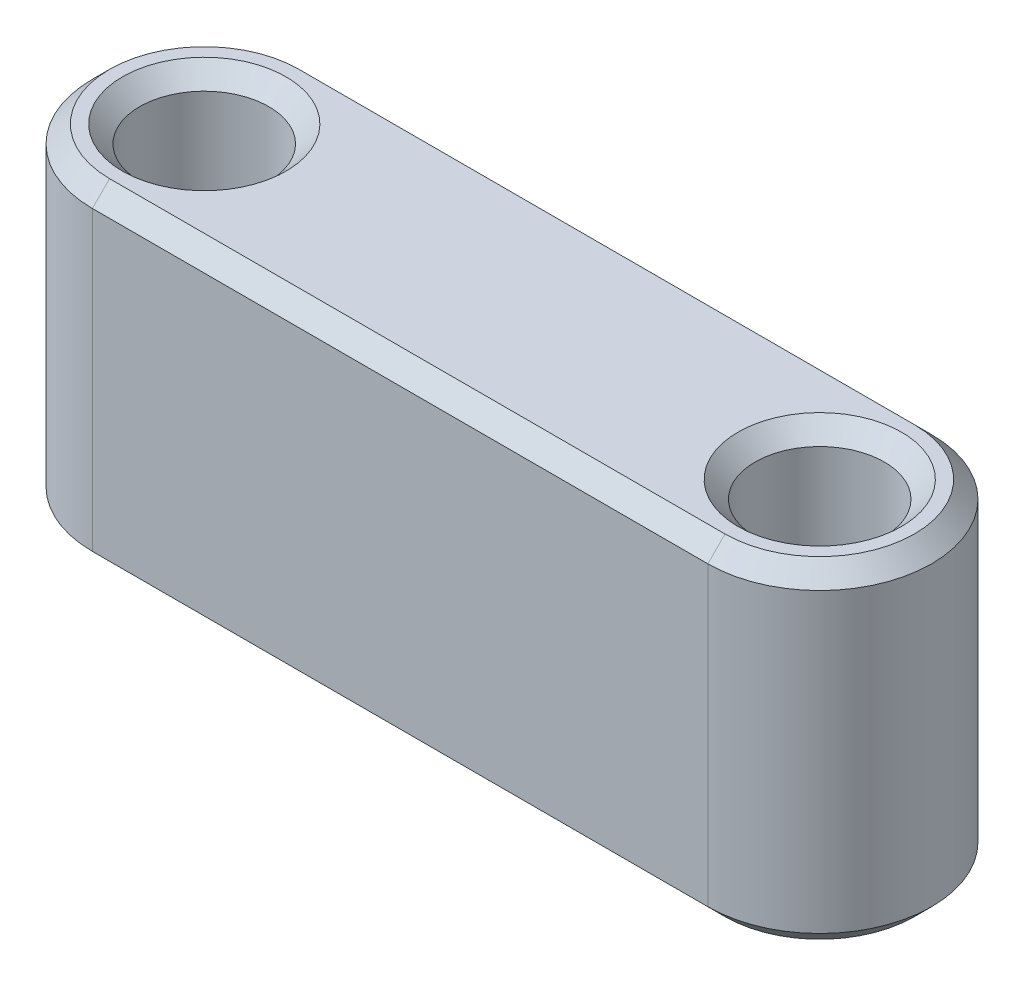
ISO-10303-21;
HEADER;
FILE_DESCRIPTION(('STEP AP214'),'2;1');
FILE_NAME('part.step','',(''),(''),'','','');
FILE_SCHEMA(('AUTOMOTIVE_DESIGN { 1 0 10303 214 1 1 1 1 }'));
ENDSEC;
DATA;
#1=APPLICATION_CONTEXT('core data for automotive mechanical design processes');
#2=APPLICATION_PROTOCOL_DEFINITION('international standard','automotive_design',2000,#1);
#3=PRODUCT_CONTEXT('',#1,'mechanical');
#4=PRODUCT('Part','Part','',(#3));
#5=PRODUCT_RELATED_PRODUCT_CATEGORY('part','',(#4));
#6=PRODUCT_DEFINITION_FORMATION('','',#4);
#7=PRODUCT_DEFINITION_CONTEXT('part definition',#1,'design');
#8=PRODUCT_DEFINITION('design','',#6,#7);
#9=PRODUCT_DEFINITION_SHAPE('','',#8);
#10=(LENGTH_UNIT() NAMED_UNIT(*) SI_UNIT(.MILLI.,.METRE.));
#11=(NAMED_UNIT(*) PLANE_ANGLE_UNIT() SI_UNIT($,.RADIAN.));
#12=(NAMED_UNIT(*) SI_UNIT($,.STERADIAN.) SOLID_ANGLE_UNIT());
#13=UNCERTAINTY_MEASURE_WITH_UNIT(LENGTH_MEASURE(1.E-05),#10,'distance_accuracy_value','');
#14=(GEOMETRIC_REPRESENTATION_CONTEXT(3) GLOBAL_UNCERTAINTY_ASSIGNED_CONTEXT((#13)) GLOBAL_UNIT_ASSIGNED_CONTEXT((#10,
#11,#12)) REPRESENTATION_CONTEXT('',''));
#15=CARTESIAN_POINT('',(0.,0.,0.));
#16=DIRECTION('',(0.,0.,1.));
#17=DIRECTION('',(1.,0.,0.));
#18=AXIS2_PLACEMENT_3D('',#15,#16,#17);
#19=CARTESIAN_POINT('',(-5.96361011368804,3.85,0.));
#20=DIRECTION('',(0.,1.,0.));
#21=DIRECTION('',(0.,0.,1.));
#22=AXIS2_PLACEMENT_3D('',#19,#20,#21);
#23=PLANE('',#22);
#24=CARTESIAN_POINT('',(8.33638988631196,3.85,0.));
#25=DIRECTION('',(0.,1.,0.));
#26=DIRECTION('',(0.,0.,1.));
#27=AXIS2_PLACEMENT_3D('',#24,#25,#26);
#28=CIRCLE('',#27,1.90000000000001);
#29=CARTESIAN_POINT('',(8.33638988631196,3.85,1.90000000000001));
#30=VERTEX_POINT('',#29);
#31=EDGE_CURVE('E11',#30,#30,#28,.F.);
#32=ORIENTED_EDGE('',*,*,#31,.T.);
#33=EDGE_LOOP('',(#32));
#34=FACE_BOUND('',#33,.T.);
#35=CARTESIAN_POINT('',(-5.96361011368804,3.85,0.));
#36=DIRECTION('',(0.,1.,0.));
#37=DIRECTION('',(0.,0.,1.));
#38=AXIS2_PLACEMENT_3D('',#35,#36,#37);
#39=CIRCLE('',#38,1.90000000000001);
#40=CARTESIAN_POINT('',(-5.96361011368804,3.85,1.90000000000001));
#41=VERTEX_POINT('',#40);
#42=EDGE_CURVE('E56',#41,#41,#39,.F.);
#43=ORIENTED_EDGE('',*,*,#42,.T.);
#44=EDGE_LOOP('',(#43));
#45=FACE_BOUND('',#44,.T.);
#46=DIRECTION('',(1.,0.,0.));
#47=VECTOR('',#46,1.);
#48=CARTESIAN_POINT('',(8.33638988631197,3.85,2.2));
#49=LINE('',#48,#47);
#50=CARTESIAN_POINT('',(-5.96361011368804,3.85,2.2));
#51=VERTEX_POINT('',#50);
#52=CARTESIAN_POINT('',(8.33638988631197,3.85,2.2));
#53=VERTEX_POINT('',#52);
#54=EDGE_CURVE('E64',#51,#53,#49,.T.);
#55=ORIENTED_EDGE('',*,*,#54,.T.);
#56=CARTESIAN_POINT('',(8.33638988631197,3.85,0.));
#57=DIRECTION('',(0.,1.,0.));
#58=DIRECTION('',(0.,0.,1.));
#59=AXIS2_PLACEMENT_3D('',#56,#57,#58);
#60=CIRCLE('',#59,2.2);
#61=CARTESIAN_POINT('',(8.33638988631197,3.85,-2.2));
#62=VERTEX_POINT('',#61);
#63=EDGE_CURVE('E181',#53,#62,#60,.T.);
#64=ORIENTED_EDGE('',*,*,#63,.T.);
#65=DIRECTION('',(-1.,0.,0.));
#66=VECTOR('',#65,1.);
#67=CARTESIAN_POINT('',(-5.96361011368804,3.85,-2.2));
#68=LINE('',#67,#66);
#69=CARTESIAN_POINT('',(-5.96361011368804,3.85,-2.2));
#70=VERTEX_POINT('',#69);
#71=EDGE_CURVE('E188',#62,#70,#68,.T.);
#72=ORIENTED_EDGE('',*,*,#71,.T.);
#73=CARTESIAN_POINT('',(-5.96361011368804,3.85,0.));
#74=DIRECTION('',(0.,1.,0.));
#75=DIRECTION('',(0.,0.,1.));
#76=AXIS2_PLACEMENT_3D('',#73,#74,#75);
#77=CIRCLE('',#76,2.2);
#78=EDGE_CURVE('E69',#70,#51,#77,.T.);
#79=ORIENTED_EDGE('',*,*,#78,.T.);
#80=EDGE_LOOP('',(#55,#64,#72,#79));
#81=FACE_BOUND('',#80,.T.);
#82=ADVANCED_FACE('F45',(#34,#45,#81),#23,.T.);
#83=CARTESIAN_POINT('',(-5.96361011368804,-3.85,0.));
#84=DIRECTION('',(0.,1.,0.));
#85=DIRECTION('',(0.,0.,1.));
#86=AXIS2_PLACEMENT_3D('',#83,#84,#85);
#87=PLANE('',#86);
#88=CARTESIAN_POINT('',(8.33638988631196,-3.85,0.));
#89=DIRECTION('',(0.,1.,0.));
#90=DIRECTION('',(0.,0.,1.));
#91=AXIS2_PLACEMENT_3D('',#88,#89,#90);
#92=CIRCLE('',#91,1.89999999999999);
#93=CARTESIAN_POINT('',(8.33638988631196,-3.85,1.89999999999999));
#94=VERTEX_POINT('',#93);
#95=EDGE_CURVE('E232',#94,#94,#92,.T.);
#96=ORIENTED_EDGE('',*,*,#95,.T.);
#97=EDGE_LOOP('',(#96));
#98=FACE_BOUND('',#97,.T.);
#99=CARTESIAN_POINT('',(-5.96361011368804,-3.85,0.));
#100=DIRECTION('',(0.,1.,0.));
#101=DIRECTION('',(0.,0.,1.));
#102=AXIS2_PLACEMENT_3D('',#99,#100,#101);
#103=CIRCLE('',#102,1.9);
#104=CARTESIAN_POINT('',(-5.96361011368804,-3.85,1.9));
#105=VERTEX_POINT('',#104);
#106=EDGE_CURVE('E236',#105,#105,#103,.T.);
#107=ORIENTED_EDGE('',*,*,#106,.T.);
#108=EDGE_LOOP('',(#107));
#109=FACE_BOUND('',#108,.T.);
#110=CARTESIAN_POINT('',(8.33638988631197,-3.85,0.));
#111=DIRECTION('',(0.,1.,0.));
#112=DIRECTION('',(0.,0.,1.));
#113=AXIS2_PLACEMENT_3D('',#110,#111,#112);
#114=CIRCLE('',#113,2.2);
#115=CARTESIAN_POINT('',(8.33638988631197,-3.85,-2.2));
#116=VERTEX_POINT('',#115);
#117=CARTESIAN_POINT('',(8.33638988631197,-3.85,2.2));
#118=VERTEX_POINT('',#117);
#119=EDGE_CURVE('E125',#116,#118,#114,.F.);
#120=ORIENTED_EDGE('',*,*,#119,.T.);
#121=DIRECTION('',(-1.,0.,0.));
#122=VECTOR('',#121,1.);
#123=CARTESIAN_POINT('',(-5.96361011368804,-3.85,2.2));
#124=LINE('',#123,#122);
#125=CARTESIAN_POINT('',(-5.96361011368804,-3.85,2.2));
#126=VERTEX_POINT('',#125);
#127=EDGE_CURVE('E120',#118,#126,#124,.T.);
#128=ORIENTED_EDGE('',*,*,#127,.T.);
#129=CARTESIAN_POINT('',(-5.96361011368804,-3.85,0.));
#130=DIRECTION('',(0.,1.,0.));
#131=DIRECTION('',(0.,0.,1.));
#132=AXIS2_PLACEMENT_3D('',#129,#130,#131);
#133=CIRCLE('',#132,2.2);
#134=CARTESIAN_POINT('',(-5.96361011368804,-3.85,-2.2));
#135=VERTEX_POINT('',#134);
#136=EDGE_CURVE('E114',#126,#135,#133,.F.);
#137=ORIENTED_EDGE('',*,*,#136,.T.);
#138=DIRECTION('',(1.,0.,0.));
#139=VECTOR('',#138,1.);
#140=CARTESIAN_POINT('',(-5.96361011368804,-3.85,-2.2));
#141=LINE('',#140,#139);
#142=EDGE_CURVE('E117',#135,#116,#141,.T.);
#143=ORIENTED_EDGE('',*,*,#142,.T.);
#144=EDGE_LOOP('',(#120,#128,#137,#143));
#145=FACE_BOUND('',#144,.T.);
#146=ADVANCED_FACE('F116',(#98,#109,#145),#87,.F.);
#147=CARTESIAN_POINT('',(-5.96361011368804,3.85,0.));
#148=DIRECTION('',(0.,-1.,0.));
#149=DIRECTION('',(0.,0.,-1.));
#150=AXIS2_PLACEMENT_3D('',#147,#148,#149);
#151=CYLINDRICAL_SURFACE('',#150,2.6);
#152=DIRECTION('',(0.,-1.,0.));
#153=VECTOR('',#152,1.);
#154=CARTESIAN_POINT('',(-5.96361011368804,3.85,-2.6));
#155=LINE('',#154,#153);
#156=CARTESIAN_POINT('',(-5.96361011368804,3.45,-2.6));
#157=VERTEX_POINT('',#156);
#158=CARTESIAN_POINT('',(-5.96361011368804,-3.45,-2.6));
#159=VERTEX_POINT('',#158);
#160=EDGE_CURVE('E142',#157,#159,#155,.T.);
#161=ORIENTED_EDGE('',*,*,#160,.T.);
#162=CARTESIAN_POINT('',(-5.96361011368804,-3.45,0.));
#163=DIRECTION('',(0.,1.,0.));
#164=DIRECTION('',(0.,0.,1.));
#165=AXIS2_PLACEMENT_3D('',#162,#163,#164);
#166=CIRCLE('',#165,2.6);
#167=CARTESIAN_POINT('',(-5.96361011368804,-3.45,2.6));
#168=VERTEX_POINT('',#167);
#169=EDGE_CURVE('E140',#159,#168,#166,.T.);
#170=ORIENTED_EDGE('',*,*,#169,.T.);
#171=DIRECTION('',(0.,-1.,0.));
#172=VECTOR('',#171,1.);
#173=CARTESIAN_POINT('',(-5.96361011368804,3.85,2.6));
#174=LINE('',#173,#172);
#175=CARTESIAN_POINT('',(-5.96361011368804,3.45,2.6));
#176=VERTEX_POINT('',#175);
#177=EDGE_CURVE('E137',#176,#168,#174,.T.);
#178=ORIENTED_EDGE('',*,*,#177,.F.);
#179=CARTESIAN_POINT('',(-5.96361011368804,3.45,0.));
#180=DIRECTION('',(0.,1.,0.));
#181=DIRECTION('',(0.,0.,1.));
#182=AXIS2_PLACEMENT_3D('',#179,#180,#181);
#183=CIRCLE('',#182,2.6);
#184=EDGE_CURVE('E199',#176,#157,#183,.F.);
#185=ORIENTED_EDGE('',*,*,#184,.T.);
#186=EDGE_LOOP('',(#161,#170,#178,#185));
#187=FACE_BOUND('',#186,.T.);
#188=ADVANCED_FACE('F278',(#187),#151,.T.);
#189=CARTESIAN_POINT('',(-5.96361011368804,3.85,2.6));
#190=DIRECTION('',(0.,0.,-1.));
#191=DIRECTION('',(-1.,0.,0.));
#192=AXIS2_PLACEMENT_3D('',#189,#190,#191);
#193=PLANE('',#192);
#194=ORIENTED_EDGE('',*,*,#177,.T.);
#195=DIRECTION('',(1.,0.,0.));
#196=VECTOR('',#195,1.);
#197=CARTESIAN_POINT('',(-5.96361011368804,-3.45,2.6));
#198=LINE('',#197,#196);
#199=CARTESIAN_POINT('',(8.33638988631197,-3.45,2.6));
#200=VERTEX_POINT('',#199);
#201=EDGE_CURVE('E209',#168,#200,#198,.T.);
#202=ORIENTED_EDGE('',*,*,#201,.T.);
#203=DIRECTION('',(0.,-1.,0.));
#204=VECTOR('',#203,1.);
#205=CARTESIAN_POINT('',(8.33638988631197,3.85,2.6));
#206=LINE('',#205,#204);
#207=CARTESIAN_POINT('',(8.33638988631197,3.45,2.6));
#208=VERTEX_POINT('',#207);
#209=EDGE_CURVE('E247',#208,#200,#206,.T.);
#210=ORIENTED_EDGE('',*,*,#209,.F.);
#211=DIRECTION('',(-1.,0.,0.));
#212=VECTOR('',#211,1.);
#213=CARTESIAN_POINT('',(-5.96361011368804,3.45,2.6));
#214=LINE('',#213,#212);
#215=EDGE_CURVE('E213',#208,#176,#214,.T.);
#216=ORIENTED_EDGE('',*,*,#215,.T.);
#217=EDGE_LOOP('',(#194,#202,#210,#216));
#218=FACE_BOUND('',#217,.T.);
#219=ADVANCED_FACE('F264',(#218),#193,.F.);
#220=CARTESIAN_POINT('',(8.33638988631197,3.85,0.));
#221=DIRECTION('',(0.,-1.,0.));
#222=DIRECTION('',(0.,0.,-1.));
#223=AXIS2_PLACEMENT_3D('',#220,#221,#222);
#224=CYLINDRICAL_SURFACE('',#223,2.6);
#225=ORIENTED_EDGE('',*,*,#209,.T.);
#226=CARTESIAN_POINT('',(8.33638988631197,-3.45,0.));
#227=DIRECTION('',(0.,1.,0.));
#228=DIRECTION('',(0.,0.,1.));
#229=AXIS2_PLACEMENT_3D('',#226,#227,#228);
#230=CIRCLE('',#229,2.6);
#231=CARTESIAN_POINT('',(8.33638988631197,-3.45,-2.6));
#232=VERTEX_POINT('',#231);
#233=EDGE_CURVE('E202',#200,#232,#230,.T.);
#234=ORIENTED_EDGE('',*,*,#233,.T.);
#235=DIRECTION('',(0.,-1.,0.));
#236=VECTOR('',#235,1.);
#237=CARTESIAN_POINT('',(8.33638988631197,3.85,-2.6));
#238=LINE('',#237,#236);
#239=CARTESIAN_POINT('',(8.33638988631197,3.45,-2.6));
#240=VERTEX_POINT('',#239);
#241=EDGE_CURVE('E147',#240,#232,#238,.T.);
#242=ORIENTED_EDGE('',*,*,#241,.F.);
#243=CARTESIAN_POINT('',(8.33638988631197,3.45,0.));
#244=DIRECTION('',(0.,1.,0.));
#245=DIRECTION('',(0.,0.,1.));
#246=AXIS2_PLACEMENT_3D('',#243,#244,#245);
#247=CIRCLE('',#246,2.6);
#248=EDGE_CURVE('E205',#240,#208,#247,.F.);
#249=ORIENTED_EDGE('',*,*,#248,.T.);
#250=EDGE_LOOP('',(#225,#234,#242,#249));
#251=FACE_BOUND('',#250,.T.);
#252=ADVANCED_FACE('F266',(#251),#224,.T.);
#253=CARTESIAN_POINT('',(-5.96361011368804,3.85,-2.6));
#254=DIRECTION('',(0.,0.,1.));
#255=DIRECTION('',(1.,0.,0.));
#256=AXIS2_PLACEMENT_3D('',#253,#254,#255);
#257=PLANE('',#256);
#258=ORIENTED_EDGE('',*,*,#241,.T.);
#259=DIRECTION('',(-1.,0.,0.));
#260=VECTOR('',#259,1.);
#261=CARTESIAN_POINT('',(-5.96361011368804,-3.45,-2.6));
#262=LINE('',#261,#260);
#263=EDGE_CURVE('E191',#232,#159,#262,.T.);
#264=ORIENTED_EDGE('',*,*,#263,.T.);
#265=ORIENTED_EDGE('',*,*,#160,.F.);
#266=DIRECTION('',(1.,0.,0.));
#267=VECTOR('',#266,1.);
#268=CARTESIAN_POINT('',(8.33638988631197,3.45,-2.6));
#269=LINE('',#268,#267);
#270=EDGE_CURVE('E194',#157,#240,#269,.T.);
#271=ORIENTED_EDGE('',*,*,#270,.T.);
#272=EDGE_LOOP('',(#258,#264,#265,#271));
#273=FACE_BOUND('',#272,.T.);
#274=ADVANCED_FACE('F255',(#273),#257,.F.);
#275=CARTESIAN_POINT('',(-5.96361011368804,3.85,0.));
#276=DIRECTION('',(0.,-1.,0.));
#277=DIRECTION('',(0.,0.,-1.));
#278=AXIS2_PLACEMENT_3D('',#275,#276,#277);
#279=CYLINDRICAL_SURFACE('',#278,1.5);
#280=CARTESIAN_POINT('',(-5.96361011368804,-3.45,0.));
#281=DIRECTION('',(0.,1.,0.));
#282=DIRECTION('',(0.,0.,1.));
#283=AXIS2_PLACEMENT_3D('',#280,#281,#282);
#284=CIRCLE('',#283,1.5);
#285=CARTESIAN_POINT('',(-5.96361011368804,-3.45,1.5));
#286=VERTEX_POINT('',#285);
#287=EDGE_CURVE('E216',#286,#286,#284,.F.);
#288=ORIENTED_EDGE('',*,*,#287,.T.);
#289=EDGE_LOOP('',(#288));
#290=FACE_BOUND('',#289,.T.);
#291=CARTESIAN_POINT('',(-5.96361011368804,3.44999999999999,0.));
#292=DIRECTION('',(0.,1.,0.));
#293=DIRECTION('',(0.,0.,1.));
#294=AXIS2_PLACEMENT_3D('',#291,#292,#293);
#295=CIRCLE('',#294,1.5);
#296=CARTESIAN_POINT('',(-5.96361011368804,3.44999999999999,1.5));
#297=VERTEX_POINT('',#296);
#298=EDGE_CURVE('E220',#297,#297,#295,.T.);
#299=ORIENTED_EDGE('',*,*,#298,.T.);
#300=EDGE_LOOP('',(#299));
#301=FACE_BOUND('',#300,.T.);
#302=ADVANCED_FACE('F283',(#290,#301),#279,.F.);
#303=CARTESIAN_POINT('',(8.33638988631196,3.85,0.));
#304=DIRECTION('',(0.,-1.,0.));
#305=DIRECTION('',(0.,0.,-1.));
#306=AXIS2_PLACEMENT_3D('',#303,#304,#305);
#307=CYLINDRICAL_SURFACE('',#306,1.5);
#308=CARTESIAN_POINT('',(8.33638988631196,-3.45000000000001,0.));
#309=DIRECTION('',(0.,1.,0.));
#310=DIRECTION('',(0.,0.,1.));
#311=AXIS2_PLACEMENT_3D('',#308,#309,#310);
#312=CIRCLE('',#311,1.5);
#313=CARTESIAN_POINT('',(8.33638988631196,-3.45000000000001,1.5));
#314=VERTEX_POINT('',#313);
#315=EDGE_CURVE('E224',#314,#314,#312,.F.);
#316=ORIENTED_EDGE('',*,*,#315,.T.);
#317=EDGE_LOOP('',(#316));
#318=FACE_BOUND('',#317,.T.);
#319=CARTESIAN_POINT('',(8.33638988631196,3.44999999999999,0.));
#320=DIRECTION('',(0.,1.,0.));
#321=DIRECTION('',(0.,0.,1.));
#322=AXIS2_PLACEMENT_3D('',#319,#320,#321);
#323=CIRCLE('',#322,1.5);
#324=CARTESIAN_POINT('',(8.33638988631196,3.44999999999999,1.5));
#325=VERTEX_POINT('',#324);
#326=EDGE_CURVE('E228',#325,#325,#323,.T.);
#327=ORIENTED_EDGE('',*,*,#326,.T.);
#328=EDGE_LOOP('',(#327));
#329=FACE_BOUND('',#328,.T.);
#330=ADVANCED_FACE('F303',(#318,#329),#307,.F.);
#331=CARTESIAN_POINT('',(8.33638988631196,-3.85,0.));
#332=DIRECTION('',(0.,-1.,0.));
#333=DIRECTION('',(0.,0.,-1.));
#334=AXIS2_PLACEMENT_3D('',#331,#332,#333);
#335=CONICAL_SURFACE('',#334,1.89999999999999,0.785398163397443);
#336=ORIENTED_EDGE('',*,*,#315,.F.);
#337=EDGE_LOOP('',(#336));
#338=FACE_BOUND('',#337,.T.);
#339=ORIENTED_EDGE('',*,*,#95,.F.);
#340=EDGE_LOOP('',(#339));
#341=FACE_BOUND('',#340,.T.);
#342=ADVANCED_FACE('F296',(#338,#341),#335,.F.);
#343=CARTESIAN_POINT('',(-5.96361011368804,-3.85,0.));
#344=DIRECTION('',(0.,-1.,0.));
#345=DIRECTION('',(0.,0.,-1.));
#346=AXIS2_PLACEMENT_3D('',#343,#344,#345);
#347=CONICAL_SURFACE('',#346,1.9,0.785398163397442);
#348=ORIENTED_EDGE('',*,*,#287,.F.);
#349=EDGE_LOOP('',(#348));
#350=FACE_BOUND('',#349,.T.);
#351=ORIENTED_EDGE('',*,*,#106,.F.);
#352=EDGE_LOOP('',(#351));
#353=FACE_BOUND('',#352,.T.);
#354=ADVANCED_FACE('F302',(#350,#353),#347,.F.);
#355=CARTESIAN_POINT('',(-5.96361011368804,-3.45,-2.6));
#356=DIRECTION('',(0.,0.707106781186552,0.707106781186543));
#357=DIRECTION('',(-1.,0.,0.));
#358=AXIS2_PLACEMENT_3D('',#355,#356,#357);
#359=PLANE('',#358);
#360=DIRECTION('',(0.,0.707106781186543,-0.707106781186552));
#361=VECTOR('',#360,1.);
#362=CARTESIAN_POINT('',(8.33638988631197,-3.85,-2.2));
#363=LINE('',#362,#361);
#364=EDGE_CURVE('E134',#116,#232,#363,.T.);
#365=ORIENTED_EDGE('',*,*,#364,.F.);
#366=ORIENTED_EDGE('',*,*,#142,.F.);
#367=DIRECTION('',(0.,-0.707106781186543,0.707106781186552));
#368=VECTOR('',#367,1.);
#369=CARTESIAN_POINT('',(-5.96361011368804,-3.45,-2.6));
#370=LINE('',#369,#368);
#371=EDGE_CURVE('E131',#159,#135,#370,.T.);
#372=ORIENTED_EDGE('',*,*,#371,.F.);
#373=ORIENTED_EDGE('',*,*,#263,.F.);
#374=EDGE_LOOP('',(#365,#366,#372,#373));
#375=FACE_BOUND('',#374,.T.);
#376=ADVANCED_FACE('F129',(#375),#359,.F.);
#377=CARTESIAN_POINT('',(-5.96361011368804,-3.45,0.));
#378=DIRECTION('',(0.,1.,0.));
#379=DIRECTION('',(0.,0.,1.));
#380=AXIS2_PLACEMENT_3D('',#377,#378,#379);
#381=CONICAL_SURFACE('',#380,2.6,0.785398163397455);
#382=ORIENTED_EDGE('',*,*,#371,.T.);
#383=ORIENTED_EDGE('',*,*,#136,.F.);
#384=DIRECTION('',(0.,-0.707106781186543,-0.707106781186552));
#385=VECTOR('',#384,1.);
#386=CARTESIAN_POINT('',(-5.96361011368804,-3.45,2.6));
#387=LINE('',#386,#385);
#388=EDGE_CURVE('E149',#168,#126,#387,.T.);
#389=ORIENTED_EDGE('',*,*,#388,.F.);
#390=ORIENTED_EDGE('',*,*,#169,.F.);
#391=EDGE_LOOP('',(#382,#383,#389,#390));
#392=FACE_BOUND('',#391,.T.);
#393=ADVANCED_FACE('F139',(#392),#381,.T.);
#394=CARTESIAN_POINT('',(8.33638988631197,-3.45,0.));
#395=DIRECTION('',(0.,1.,0.));
#396=DIRECTION('',(0.,0.,1.));
#397=AXIS2_PLACEMENT_3D('',#394,#395,#396);
#398=CONICAL_SURFACE('',#397,2.6,0.785398163397455);
#399=ORIENTED_EDGE('',*,*,#364,.T.);
#400=ORIENTED_EDGE('',*,*,#233,.F.);
#401=DIRECTION('',(0.,0.707106781186543,0.707106781186552));
#402=VECTOR('',#401,1.);
#403=CARTESIAN_POINT('',(8.33638988631197,-3.85,2.2));
#404=LINE('',#403,#402);
#405=EDGE_CURVE('E167',#118,#200,#404,.T.);
#406=ORIENTED_EDGE('',*,*,#405,.F.);
#407=ORIENTED_EDGE('',*,*,#119,.F.);
#408=EDGE_LOOP('',(#399,#400,#406,#407));
#409=FACE_BOUND('',#408,.T.);
#410=ADVANCED_FACE('F260',(#409),#398,.T.);
#411=CARTESIAN_POINT('',(-5.96361011368804,-3.45,2.6));
#412=DIRECTION('',(0.,0.707106781186552,-0.707106781186543));
#413=DIRECTION('',(1.,0.,0.));
#414=AXIS2_PLACEMENT_3D('',#411,#412,#413);
#415=PLANE('',#414);
#416=ORIENTED_EDGE('',*,*,#388,.T.);
#417=ORIENTED_EDGE('',*,*,#127,.F.);
#418=ORIENTED_EDGE('',*,*,#405,.T.);
#419=ORIENTED_EDGE('',*,*,#201,.F.);
#420=EDGE_LOOP('',(#416,#417,#418,#419));
#421=FACE_BOUND('',#420,.T.);
#422=ADVANCED_FACE('F261',(#421),#415,.F.);
#423=CARTESIAN_POINT('',(8.33638988631196,3.44999999999999,0.));
#424=DIRECTION('',(0.,1.,0.));
#425=DIRECTION('',(0.,0.,1.));
#426=AXIS2_PLACEMENT_3D('',#423,#424,#425);
#427=CONICAL_SURFACE('',#426,1.5,0.785398163397453);
#428=ORIENTED_EDGE('',*,*,#31,.F.);
#429=EDGE_LOOP('',(#428));
#430=FACE_BOUND('',#429,.T.);
#431=ORIENTED_EDGE('',*,*,#326,.F.);
#432=EDGE_LOOP('',(#431));
#433=FACE_BOUND('',#432,.T.);
#434=ADVANCED_FACE('F318',(#430,#433),#427,.F.);
#435=CARTESIAN_POINT('',(-5.96361011368804,3.44999999999999,0.));
#436=DIRECTION('',(0.,1.,0.));
#437=DIRECTION('',(0.,0.,1.));
#438=AXIS2_PLACEMENT_3D('',#435,#436,#437);
#439=CONICAL_SURFACE('',#438,1.5,0.785398163397453);
#440=ORIENTED_EDGE('',*,*,#42,.F.);
#441=EDGE_LOOP('',(#440));
#442=FACE_BOUND('',#441,.T.);
#443=ORIENTED_EDGE('',*,*,#298,.F.);
#444=EDGE_LOOP('',(#443));
#445=FACE_BOUND('',#444,.T.);
#446=ADVANCED_FACE('F337',(#442,#445),#439,.F.);
#447=CARTESIAN_POINT('',(-5.96361011368804,3.85,0.));
#448=DIRECTION('',(0.,-1.,0.));
#449=DIRECTION('',(0.,0.,-1.));
#450=AXIS2_PLACEMENT_3D('',#447,#448,#449);
#451=CONICAL_SURFACE('',#450,2.2,0.785398163397444);
#452=DIRECTION('',(0.,0.707106781186551,0.707106781186545));
#453=VECTOR('',#452,1.);
#454=CARTESIAN_POINT('',(-5.96361011368804,3.45,-2.6));
#455=LINE('',#454,#453);
#456=EDGE_CURVE('E158',#157,#70,#455,.T.);
#457=ORIENTED_EDGE('',*,*,#456,.F.);
#458=ORIENTED_EDGE('',*,*,#184,.F.);
#459=DIRECTION('',(0.,-0.707106781186551,0.707106781186545));
#460=VECTOR('',#459,1.);
#461=CARTESIAN_POINT('',(-5.96361011368804,3.85,2.2));
#462=LINE('',#461,#460);
#463=EDGE_CURVE('E50',#51,#176,#462,.T.);
#464=ORIENTED_EDGE('',*,*,#463,.F.);
#465=ORIENTED_EDGE('',*,*,#78,.F.);
#466=EDGE_LOOP('',(#457,#458,#464,#465));
#467=FACE_BOUND('',#466,.T.);
#468=ADVANCED_FACE('F48',(#467),#451,.T.);
#469=CARTESIAN_POINT('',(-5.96361011368804,3.85,2.2));
#470=DIRECTION('',(0.,0.707106781186545,0.707106781186551));
#471=DIRECTION('',(-1.,0.,0.));
#472=AXIS2_PLACEMENT_3D('',#469,#470,#471);
#473=PLANE('',#472);
#474=ORIENTED_EDGE('',*,*,#463,.T.);
#475=ORIENTED_EDGE('',*,*,#215,.F.);
#476=DIRECTION('',(0.,-0.707106781186551,0.707106781186545));
#477=VECTOR('',#476,1.);
#478=CARTESIAN_POINT('',(8.33638988631197,3.85,2.2));
#479=LINE('',#478,#477);
#480=EDGE_CURVE('E156',#53,#208,#479,.T.);
#481=ORIENTED_EDGE('',*,*,#480,.F.);
#482=ORIENTED_EDGE('',*,*,#54,.F.);
#483=EDGE_LOOP('',(#474,#475,#481,#482));
#484=FACE_BOUND('',#483,.T.);
#485=ADVANCED_FACE('F354',(#484),#473,.T.);
#486=CARTESIAN_POINT('',(-5.96361011368804,3.85,-2.2));
#487=DIRECTION('',(0.,0.707106781186545,-0.707106781186551));
#488=DIRECTION('',(1.,0.,0.));
#489=AXIS2_PLACEMENT_3D('',#486,#487,#488);
#490=PLANE('',#489);
#491=ORIENTED_EDGE('',*,*,#456,.T.);
#492=ORIENTED_EDGE('',*,*,#71,.F.);
#493=DIRECTION('',(0.,0.707106781186551,0.707106781186545));
#494=VECTOR('',#493,1.);
#495=CARTESIAN_POINT('',(8.33638988631197,3.45,-2.6));
#496=LINE('',#495,#494);
#497=EDGE_CURVE('E153',#240,#62,#496,.T.);
#498=ORIENTED_EDGE('',*,*,#497,.F.);
#499=ORIENTED_EDGE('',*,*,#270,.F.);
#500=EDGE_LOOP('',(#491,#492,#498,#499));
#501=FACE_BOUND('',#500,.T.);
#502=ADVANCED_FACE('F271',(#501),#490,.T.);
#503=CARTESIAN_POINT('',(8.33638988631197,3.85,0.));
#504=DIRECTION('',(0.,-1.,0.));
#505=DIRECTION('',(0.,0.,-1.));
#506=AXIS2_PLACEMENT_3D('',#503,#504,#505);
#507=CONICAL_SURFACE('',#506,2.2,0.785398163397444);
#508=ORIENTED_EDGE('',*,*,#480,.T.);
#509=ORIENTED_EDGE('',*,*,#248,.F.);
#510=ORIENTED_EDGE('',*,*,#497,.T.);
#511=ORIENTED_EDGE('',*,*,#63,.F.);
#512=EDGE_LOOP('',(#508,#509,#510,#511));
#513=FACE_BOUND('',#512,.T.);
#514=ADVANCED_FACE('F269',(#513),#507,.T.);
#515=CLOSED_SHELL('',(#82,#146,#188,#219,#252,#274,#302,#330,#342,#354,#376,#393,#410,#422,#434,
#446,#468,#485,#502,#514));
#516=MANIFOLD_SOLID_BREP('B2',#515);
#517=ADVANCED_BREP_SHAPE_REPRESENTATION('',(#18,#516),#14);
#518=SHAPE_DEFINITION_REPRESENTATION(#9,#517);
ENDSEC;
END-ISO-10303-21;
